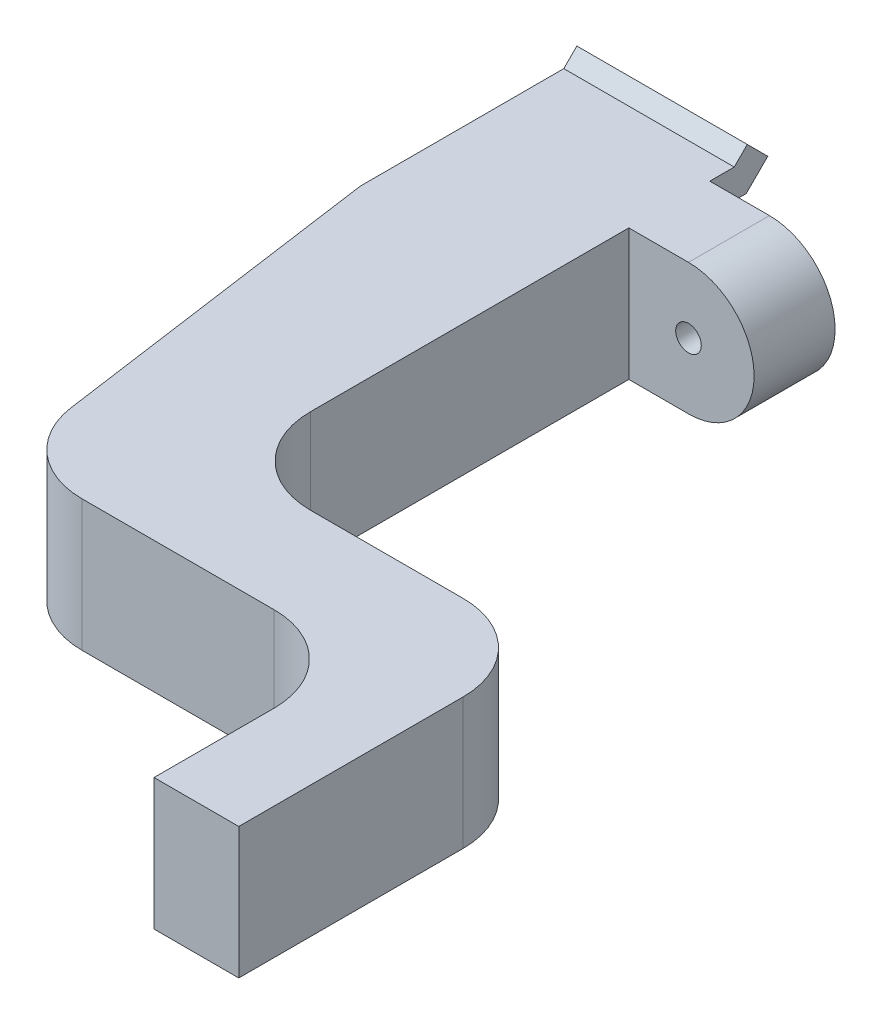
ISO-10303-21;
HEADER;
FILE_DESCRIPTION(('STEP AP214'),'2;1');
FILE_NAME('part.step','',(''),(''),'','','');
FILE_SCHEMA(('AUTOMOTIVE_DESIGN { 1 0 10303 214 1 1 1 1 }'));
ENDSEC;
DATA;
#1=APPLICATION_CONTEXT('core data for automotive mechanical design processes');
#2=APPLICATION_PROTOCOL_DEFINITION('international standard','automotive_design',2000,#1);
#3=PRODUCT_CONTEXT('',#1,'mechanical');
#4=PRODUCT('Part','Part','',(#3));
#5=PRODUCT_RELATED_PRODUCT_CATEGORY('part','',(#4));
#6=PRODUCT_DEFINITION_FORMATION('','',#4);
#7=PRODUCT_DEFINITION_CONTEXT('part definition',#1,'design');
#8=PRODUCT_DEFINITION('design','',#6,#7);
#9=PRODUCT_DEFINITION_SHAPE('','',#8);
#10=(LENGTH_UNIT() NAMED_UNIT(*) SI_UNIT(.MILLI.,.METRE.));
#11=(NAMED_UNIT(*) PLANE_ANGLE_UNIT() SI_UNIT($,.RADIAN.));
#12=(NAMED_UNIT(*) SI_UNIT($,.STERADIAN.) SOLID_ANGLE_UNIT());
#13=UNCERTAINTY_MEASURE_WITH_UNIT(LENGTH_MEASURE(1.E-05),#10,'distance_accuracy_value','');
#14=(GEOMETRIC_REPRESENTATION_CONTEXT(3) GLOBAL_UNCERTAINTY_ASSIGNED_CONTEXT((#13)) GLOBAL_UNIT_ASSIGNED_CONTEXT((#10,
#11,#12)) REPRESENTATION_CONTEXT('',''));
#15=CARTESIAN_POINT('',(0.,0.,0.));
#16=DIRECTION('',(0.,0.,1.));
#17=DIRECTION('',(1.,0.,0.));
#18=AXIS2_PLACEMENT_3D('',#15,#16,#17);
#19=CARTESIAN_POINT('',(5.,-5.8181568544759,5.));
#20=DIRECTION('',(-1.,0.,0.));
#21=DIRECTION('',(0.,0.,1.));
#22=AXIS2_PLACEMENT_3D('',#19,#20,#21);
#23=PLANE('',#22);
#24=DIRECTION('',(0.,0.,1.));
#25=VECTOR('',#24,1.);
#26=CARTESIAN_POINT('',(5.,5.77025558493693,-0.150000000000003));
#27=LINE('',#26,#25);
#28=CARTESIAN_POINT('',(5.,5.77025558493693,-1.43370490960978));
#29=VERTEX_POINT('',#28);
#30=CARTESIAN_POINT('',(5.,5.77025558493693,0.));
#31=VERTEX_POINT('',#30);
#32=EDGE_CURVE('E50',#29,#31,#27,.T.);
#33=ORIENTED_EDGE('',*,*,#32,.T.);
#34=DIRECTION('',(0.,-1.,0.));
#35=VECTOR('',#34,1.);
#36=CARTESIAN_POINT('',(5.,-1.92974441504707,0.));
#37=LINE('',#36,#35);
#38=CARTESIAN_POINT('',(5.,4.07025558493702,0.));
#39=VERTEX_POINT('',#38);
#40=EDGE_CURVE('E230',#31,#39,#37,.T.);
#41=ORIENTED_EDGE('',*,*,#40,.T.);
#42=DIRECTION('',(0.,-5.89805981832101E-13,-1.));
#43=VECTOR('',#42,1.);
#44=CARTESIAN_POINT('',(5.,4.07025558493702,0.));
#45=LINE('',#44,#43);
#46=CARTESIAN_POINT('',(5.,4.07025558493693,-2.13786796564404));
#47=VERTEX_POINT('',#46);
#48=EDGE_CURVE('E373',#39,#47,#45,.T.);
#49=ORIENTED_EDGE('',*,*,#48,.T.);
#50=DIRECTION('',(0.,0.707106781186548,-0.707106781186547));
#51=VECTOR('',#50,1.);
#52=CARTESIAN_POINT('',(5.,5.33446914731003,-3.40208152801713));
#53=LINE('',#52,#51);
#54=CARTESIAN_POINT('',(5.,5.33446914731003,-3.40208152801713));
#55=VERTEX_POINT('',#54);
#56=EDGE_CURVE('E371',#47,#55,#53,.T.);
#57=ORIENTED_EDGE('',*,*,#56,.T.);
#58=DIRECTION('',(0.,0.707106781186546,0.707106781186549));
#59=VECTOR('',#58,1.);
#60=CARTESIAN_POINT('',(5.,6.53655067532716,-2.2));
#61=LINE('',#60,#59);
#62=CARTESIAN_POINT('',(5.,6.53655067532716,-2.2));
#63=VERTEX_POINT('',#62);
#64=EDGE_CURVE('E368',#55,#63,#61,.T.);
#65=ORIENTED_EDGE('',*,*,#64,.T.);
#66=DIRECTION('',(0.,-0.707106781186548,0.707106781186547));
#67=VECTOR('',#66,1.);
#68=CARTESIAN_POINT('',(5.,5.77025558493693,-1.43370490960978));
#69=LINE('',#68,#67);
#70=EDGE_CURVE('E366',#63,#29,#69,.T.);
#71=ORIENTED_EDGE('',*,*,#70,.T.);
#72=EDGE_LOOP('',(#33,#41,#49,#57,#65,#71));
#73=FACE_BOUND('',#72,.T.);
#74=ADVANCED_FACE('F42',(#73),#23,.F.);
#75=DIRECTION('',(0.,0.,1.));
#76=VECTOR('',#75,1.);
#77=CARTESIAN_POINT('',(5.,-0.22974441506307,-0.150000000000003));
#78=LINE('',#77,#76);
#79=CARTESIAN_POINT('',(5.,-0.22974441506307,-1.43370490960978));
#80=VERTEX_POINT('',#79);
#81=CARTESIAN_POINT('',(5.,-0.22974441506307,0.));
#82=VERTEX_POINT('',#81);
#83=EDGE_CURVE('E227',#80,#82,#78,.T.);
#84=ORIENTED_EDGE('',*,*,#83,.T.);
#85=CARTESIAN_POINT('',(5.,-1.92974441504707,0.));
#86=VERTEX_POINT('',#85);
#87=EDGE_CURVE('E224',#82,#86,#37,.T.);
#88=ORIENTED_EDGE('',*,*,#87,.T.);
#89=DIRECTION('',(0.,-4.61147324030491E-13,-1.));
#90=VECTOR('',#89,1.);
#91=CARTESIAN_POINT('',(5.,-1.92974441506307,-0.150000000000003));
#92=LINE('',#91,#90);
#93=CARTESIAN_POINT('',(5.,-1.92974441506307,-2.13786796564404));
#94=VERTEX_POINT('',#93);
#95=EDGE_CURVE('E208',#86,#94,#92,.T.);
#96=ORIENTED_EDGE('',*,*,#95,.T.);
#97=DIRECTION('',(0.,0.707106781186549,-0.707106781186546));
#98=VECTOR('',#97,1.);
#99=CARTESIAN_POINT('',(5.,-0.665530852689974,-3.40208152801713));
#100=LINE('',#99,#98);
#101=CARTESIAN_POINT('',(5.,-0.665530852689974,-3.40208152801713));
#102=VERTEX_POINT('',#101);
#103=EDGE_CURVE('E220',#94,#102,#100,.T.);
#104=ORIENTED_EDGE('',*,*,#103,.T.);
#105=DIRECTION('',(0.,0.707106781186548,0.707106781186548));
#106=VECTOR('',#105,1.);
#107=CARTESIAN_POINT('',(5.,0.536550675327156,-2.2));
#108=LINE('',#107,#106);
#109=CARTESIAN_POINT('',(5.,0.536550675327156,-2.2));
#110=VERTEX_POINT('',#109);
#111=EDGE_CURVE('E339',#102,#110,#108,.T.);
#112=ORIENTED_EDGE('',*,*,#111,.T.);
#113=DIRECTION('',(0.,-0.707106781186546,0.707106781186549));
#114=VECTOR('',#113,1.);
#115=CARTESIAN_POINT('',(5.,-0.22974441506307,-1.43370490960978));
#116=LINE('',#115,#114);
#117=EDGE_CURVE('E337',#110,#80,#116,.T.);
#118=ORIENTED_EDGE('',*,*,#117,.T.);
#119=EDGE_LOOP('',(#84,#88,#96,#104,#112,#118));
#120=FACE_BOUND('',#119,.T.);
#121=ADVANCED_FACE('F225',(#120),#23,.F.);
#122=CARTESIAN_POINT('',(5.,-1.9297444150522,23.4327975796501));
#123=VERTEX_POINT('',#122);
#124=CARTESIAN_POINT('',(5.,-1.92974441506081,4.75000000000266));
#125=VERTEX_POINT('',#124);
#126=EDGE_CURVE('E219',#123,#125,#92,.T.);
#127=ORIENTED_EDGE('',*,*,#126,.T.);
#128=DIRECTION('',(0.,-1.,0.));
#129=VECTOR('',#128,1.);
#130=CARTESIAN_POINT('',(5.,-1.92974441504707,4.75000000000266));
#131=LINE('',#130,#129);
#132=CARTESIAN_POINT('',(5.,5.77025558493693,4.75000000000266));
#133=VERTEX_POINT('',#132);
#134=EDGE_CURVE('E57',#133,#125,#131,.T.);
#135=ORIENTED_EDGE('',*,*,#134,.F.);
#136=CARTESIAN_POINT('',(5.,5.77025558493693,23.4327975796501));
#137=VERTEX_POINT('',#136);
#138=EDGE_CURVE('E375',#133,#137,#27,.T.);
#139=ORIENTED_EDGE('',*,*,#138,.T.);
#140=DIRECTION('',(0.,1.,0.));
#141=VECTOR('',#140,1.);
#142=CARTESIAN_POINT('',(5.,-52.6225137457556,23.4327975796501));
#143=LINE('',#142,#141);
#144=EDGE_CURVE('E306',#123,#137,#143,.T.);
#145=ORIENTED_EDGE('',*,*,#144,.F.);
#146=EDGE_LOOP('',(#127,#135,#139,#145));
#147=FACE_BOUND('',#146,.T.);
#148=ADVANCED_FACE('F44',(#147),#23,.F.);
#149=CARTESIAN_POINT('',(-5.,-5.8181568544759,5.));
#150=DIRECTION('',(1.,0.,0.));
#151=DIRECTION('',(0.,0.,-1.));
#152=AXIS2_PLACEMENT_3D('',#149,#150,#151);
#153=PLANE('',#152);
#154=DIRECTION('',(0.,4.61147324030491E-13,1.));
#155=VECTOR('',#154,1.);
#156=CARTESIAN_POINT('',(-5.,-1.92974441506307,-0.150000000000003));
#157=LINE('',#156,#155);
#158=CARTESIAN_POINT('',(-5.,-1.92974441506307,-2.13786796564404));
#159=VERTEX_POINT('',#158);
#160=CARTESIAN_POINT('',(-5.,-1.92974441505816,10.5));
#161=VERTEX_POINT('',#160);
#162=EDGE_CURVE('E353',#159,#161,#157,.T.);
#163=ORIENTED_EDGE('',*,*,#162,.T.);
#164=DIRECTION('',(0.,1.,0.));
#165=VECTOR('',#164,1.);
#166=CARTESIAN_POINT('',(-5.,-52.6225137457556,10.5));
#167=LINE('',#166,#165);
#168=CARTESIAN_POINT('',(-5.,5.77025558493693,10.5));
#169=VERTEX_POINT('',#168);
#170=EDGE_CURVE('E302',#161,#169,#167,.T.);
#171=ORIENTED_EDGE('',*,*,#170,.T.);
#172=DIRECTION('',(0.,0.,-1.));
#173=VECTOR('',#172,1.);
#174=CARTESIAN_POINT('',(-5.,5.77025558493693,-0.150000000000003));
#175=LINE('',#174,#173);
#176=CARTESIAN_POINT('',(-5.,5.77025558493693,-1.43370490960978));
#177=VERTEX_POINT('',#176);
#178=EDGE_CURVE('E365',#169,#177,#175,.T.);
#179=ORIENTED_EDGE('',*,*,#178,.T.);
#180=DIRECTION('',(0.,0.707106781186548,-0.707106781186547));
#181=VECTOR('',#180,1.);
#182=CARTESIAN_POINT('',(-5.,5.77025558493693,-1.43370490960978));
#183=LINE('',#182,#181);
#184=CARTESIAN_POINT('',(-5.,6.53655067532716,-2.2));
#185=VERTEX_POINT('',#184);
#186=EDGE_CURVE('E378',#177,#185,#183,.T.);
#187=ORIENTED_EDGE('',*,*,#186,.T.);
#188=DIRECTION('',(0.,-0.707106781186546,-0.707106781186549));
#189=VECTOR('',#188,1.);
#190=CARTESIAN_POINT('',(-5.,6.53655067532716,-2.2));
#191=LINE('',#190,#189);
#192=CARTESIAN_POINT('',(-5.,5.33446914731003,-3.40208152801713));
#193=VERTEX_POINT('',#192);
#194=EDGE_CURVE('E381',#185,#193,#191,.T.);
#195=ORIENTED_EDGE('',*,*,#194,.T.);
#196=DIRECTION('',(0.,-0.707106781186548,0.707106781186547));
#197=VECTOR('',#196,1.);
#198=CARTESIAN_POINT('',(-5.,5.33446914731003,-3.40208152801713));
#199=LINE('',#198,#197);
#200=CARTESIAN_POINT('',(-5.,4.07025558493693,-2.13786796564404));
#201=VERTEX_POINT('',#200);
#202=EDGE_CURVE('E384',#193,#201,#199,.T.);
#203=ORIENTED_EDGE('',*,*,#202,.T.);
#204=DIRECTION('',(0.,5.89805981832101E-13,1.));
#205=VECTOR('',#204,1.);
#206=CARTESIAN_POINT('',(-5.,4.07025558493702,0.));
#207=LINE('',#206,#205);
#208=CARTESIAN_POINT('',(-5.,4.07025558493702,0.));
#209=VERTEX_POINT('',#208);
#210=EDGE_CURVE('E387',#201,#209,#207,.T.);
#211=ORIENTED_EDGE('',*,*,#210,.T.);
#212=DIRECTION('',(0.,-1.,0.));
#213=VECTOR('',#212,1.);
#214=CARTESIAN_POINT('',(-5.,-5.8181568544759,0.));
#215=LINE('',#214,#213);
#216=CARTESIAN_POINT('',(-5.,-0.229744415063002,0.));
#217=VERTEX_POINT('',#216);
#218=EDGE_CURVE('E12',#209,#217,#215,.T.);
#219=ORIENTED_EDGE('',*,*,#218,.T.);
#220=DIRECTION('',(0.,0.,-1.));
#221=VECTOR('',#220,1.);
#222=CARTESIAN_POINT('',(-5.,-0.22974441506307,-0.150000000000003));
#223=LINE('',#222,#221);
#224=CARTESIAN_POINT('',(-5.,-0.22974441506307,-1.43370490960978));
#225=VERTEX_POINT('',#224);
#226=EDGE_CURVE('E336',#217,#225,#223,.T.);
#227=ORIENTED_EDGE('',*,*,#226,.T.);
#228=DIRECTION('',(0.,0.707106781186546,-0.707106781186549));
#229=VECTOR('',#228,1.);
#230=CARTESIAN_POINT('',(-5.,-0.22974441506307,-1.43370490960978));
#231=LINE('',#230,#229);
#232=CARTESIAN_POINT('',(-5.,0.536550675327156,-2.2));
#233=VERTEX_POINT('',#232);
#234=EDGE_CURVE('E344',#225,#233,#231,.T.);
#235=ORIENTED_EDGE('',*,*,#234,.T.);
#236=DIRECTION('',(0.,-0.707106781186548,-0.707106781186548));
#237=VECTOR('',#236,1.);
#238=CARTESIAN_POINT('',(-5.,0.536550675327156,-2.2));
#239=LINE('',#238,#237);
#240=CARTESIAN_POINT('',(-5.,-0.665530852689974,-3.40208152801713));
#241=VERTEX_POINT('',#240);
#242=EDGE_CURVE('E347',#233,#241,#239,.T.);
#243=ORIENTED_EDGE('',*,*,#242,.T.);
#244=DIRECTION('',(0.,-0.707106781186549,0.707106781186546));
#245=VECTOR('',#244,1.);
#246=CARTESIAN_POINT('',(-5.,-0.665530852689974,-3.40208152801713));
#247=LINE('',#246,#245);
#248=EDGE_CURVE('E350',#241,#159,#247,.T.);
#249=ORIENTED_EDGE('',*,*,#248,.T.);
#250=EDGE_LOOP('',(#163,#171,#179,#187,#195,#203,#211,#219,#227,#235,#243,#249));
#251=FACE_BOUND('',#250,.T.);
#252=ADVANCED_FACE('F442',(#251),#153,.F.);
#253=CARTESIAN_POINT('',(0.,0.,0.));
#254=DIRECTION('',(0.,0.,-1.));
#255=DIRECTION('',(-1.,0.,0.));
#256=AXIS2_PLACEMENT_3D('',#253,#254,#255);
#257=PLANE('',#256);
#258=DIRECTION('',(-1.,0.,0.));
#259=VECTOR('',#258,1.);
#260=CARTESIAN_POINT('',(9.20199597764661,-0.229744415063002,0.));
#261=LINE('',#260,#259);
#262=EDGE_CURVE('E355',#82,#217,#261,.T.);
#263=ORIENTED_EDGE('',*,*,#262,.T.);
#264=ORIENTED_EDGE('',*,*,#218,.F.);
#265=DIRECTION('',(-1.,0.,0.));
#266=VECTOR('',#265,1.);
#267=CARTESIAN_POINT('',(9.20199597764661,4.07025558493702,0.));
#268=LINE('',#267,#266);
#269=EDGE_CURVE('E369',#39,#209,#268,.T.);
#270=ORIENTED_EDGE('',*,*,#269,.F.);
#271=ORIENTED_EDGE('',*,*,#40,.F.);
#272=DIRECTION('',(-1.,0.,0.));
#273=VECTOR('',#272,1.);
#274=CARTESIAN_POINT('',(5.,5.77025558493694,0.));
#275=LINE('',#274,#273);
#276=CARTESIAN_POINT('',(8.5,5.77025558493694,0.));
#277=VERTEX_POINT('',#276);
#278=EDGE_CURVE('E239',#277,#31,#275,.T.);
#279=ORIENTED_EDGE('',*,*,#278,.F.);
#280=CARTESIAN_POINT('',(8.5,1.92025558494493,0.));
#281=DIRECTION('',(0.,0.,1.));
#282=DIRECTION('',(-1.,0.,0.));
#283=AXIS2_PLACEMENT_3D('',#280,#281,#282);
#284=CIRCLE('',#283,3.84999999999201);
#285=CARTESIAN_POINT('',(8.5,-1.92974441504708,0.));
#286=VERTEX_POINT('',#285);
#287=EDGE_CURVE('E237',#286,#277,#284,.T.);
#288=ORIENTED_EDGE('',*,*,#287,.F.);
#289=DIRECTION('',(1.,0.,0.));
#290=VECTOR('',#289,1.);
#291=CARTESIAN_POINT('',(8.5,-1.92974441504707,0.));
#292=LINE('',#291,#290);
#293=EDGE_CURVE('E213',#86,#286,#292,.T.);
#294=ORIENTED_EDGE('',*,*,#293,.F.);
#295=ORIENTED_EDGE('',*,*,#87,.F.);
#296=EDGE_LOOP('',(#263,#264,#270,#271,#279,#288,#294,#295));
#297=FACE_BOUND('',#296,.T.);
#298=CARTESIAN_POINT('',(8.5,1.92025558494493,0.));
#299=DIRECTION('',(0.,0.,1.));
#300=DIRECTION('',(1.,0.,0.));
#301=AXIS2_PLACEMENT_3D('',#298,#299,#300);
#302=CIRCLE('',#301,0.750000000000108);
#303=CARTESIAN_POINT('',(9.25000000000011,1.92025558494493,0.));
#304=VERTEX_POINT('',#303);
#305=EDGE_CURVE('E231',#304,#304,#302,.T.);
#306=ORIENTED_EDGE('',*,*,#305,.T.);
#307=EDGE_LOOP('',(#306));
#308=FACE_BOUND('',#307,.T.);
#309=ADVANCED_FACE('F233',(#297,#308),#257,.T.);
#310=CARTESIAN_POINT('',(9.20199597764661,4.07025558493702,0.));
#311=DIRECTION('',(0.,-1.,5.89805981832101E-13));
#312=DIRECTION('',(0.,-5.89805981832101E-13,-1.));
#313=AXIS2_PLACEMENT_3D('',#310,#311,#312);
#314=PLANE('',#313);
#315=ORIENTED_EDGE('',*,*,#48,.F.);
#316=ORIENTED_EDGE('',*,*,#269,.T.);
#317=ORIENTED_EDGE('',*,*,#210,.F.);
#318=DIRECTION('',(-1.,0.,0.));
#319=VECTOR('',#318,1.);
#320=CARTESIAN_POINT('',(9.20199597764661,4.07025558493693,-2.13786796564404));
#321=LINE('',#320,#319);
#322=EDGE_CURVE('E393',#47,#201,#321,.T.);
#323=ORIENTED_EDGE('',*,*,#322,.F.);
#324=EDGE_LOOP('',(#315,#316,#317,#323));
#325=FACE_BOUND('',#324,.T.);
#326=ADVANCED_FACE('F440',(#325),#314,.T.);
#327=CARTESIAN_POINT('',(9.20199597764661,5.33446914731003,-3.40208152801713));
#328=DIRECTION('',(0.,-0.707106781186547,-0.707106781186548));
#329=DIRECTION('',(0.,0.707106781186548,-0.707106781186547));
#330=AXIS2_PLACEMENT_3D('',#327,#328,#329);
#331=PLANE('',#330);
#332=ORIENTED_EDGE('',*,*,#56,.F.);
#333=ORIENTED_EDGE('',*,*,#322,.T.);
#334=ORIENTED_EDGE('',*,*,#202,.F.);
#335=DIRECTION('',(-1.,0.,0.));
#336=VECTOR('',#335,1.);
#337=CARTESIAN_POINT('',(9.20199597764661,5.33446914731003,-3.40208152801713));
#338=LINE('',#337,#336);
#339=EDGE_CURVE('E395',#55,#193,#338,.T.);
#340=ORIENTED_EDGE('',*,*,#339,.F.);
#341=EDGE_LOOP('',(#332,#333,#334,#340));
#342=FACE_BOUND('',#341,.T.);
#343=ADVANCED_FACE('F437',(#342),#331,.T.);
#344=CARTESIAN_POINT('',(9.20199597764661,6.53655067532716,-2.2));
#345=DIRECTION('',(0.,0.707106781186549,-0.707106781186546));
#346=DIRECTION('',(0.,0.707106781186546,0.707106781186549));
#347=AXIS2_PLACEMENT_3D('',#344,#345,#346);
#348=PLANE('',#347);
#349=ORIENTED_EDGE('',*,*,#64,.F.);
#350=ORIENTED_EDGE('',*,*,#339,.T.);
#351=ORIENTED_EDGE('',*,*,#194,.F.);
#352=DIRECTION('',(-1.,0.,0.));
#353=VECTOR('',#352,1.);
#354=CARTESIAN_POINT('',(9.20199597764661,6.53655067532716,-2.2));
#355=LINE('',#354,#353);
#356=EDGE_CURVE('E397',#63,#185,#355,.T.);
#357=ORIENTED_EDGE('',*,*,#356,.F.);
#358=EDGE_LOOP('',(#349,#350,#351,#357));
#359=FACE_BOUND('',#358,.T.);
#360=ADVANCED_FACE('F447',(#359),#348,.T.);
#361=CARTESIAN_POINT('',(9.20199597764661,5.77025558493693,-1.43370490960978));
#362=DIRECTION('',(0.,0.707106781186547,0.707106781186548));
#363=DIRECTION('',(0.,-0.707106781186548,0.707106781186547));
#364=AXIS2_PLACEMENT_3D('',#361,#362,#363);
#365=PLANE('',#364);
#366=ORIENTED_EDGE('',*,*,#70,.F.);
#367=ORIENTED_EDGE('',*,*,#356,.T.);
#368=ORIENTED_EDGE('',*,*,#186,.F.);
#369=DIRECTION('',(-1.,0.,0.));
#370=VECTOR('',#369,1.);
#371=CARTESIAN_POINT('',(9.20199597764661,5.77025558493693,-1.43370490960978));
#372=LINE('',#371,#370);
#373=EDGE_CURVE('E390',#29,#177,#372,.T.);
#374=ORIENTED_EDGE('',*,*,#373,.F.);
#375=EDGE_LOOP('',(#366,#367,#368,#374));
#376=FACE_BOUND('',#375,.T.);
#377=ADVANCED_FACE('F451',(#376),#365,.T.);
#378=CARTESIAN_POINT('',(9.20199597764661,5.77025558493693,-0.150000000000003));
#379=DIRECTION('',(0.,1.,0.));
#380=DIRECTION('',(0.,0.,1.));
#381=AXIS2_PLACEMENT_3D('',#378,#379,#380);
#382=PLANE('',#381);
#383=ORIENTED_EDGE('',*,*,#32,.F.);
#384=ORIENTED_EDGE('',*,*,#373,.T.);
#385=ORIENTED_EDGE('',*,*,#178,.F.);
#386=DIRECTION('',(0.139173100960066,0.,0.99026806874157));
#387=VECTOR('',#386,1.);
#388=CARTESIAN_POINT('',(-5.,5.77025558493693,10.5));
#389=LINE('',#388,#387);
#390=CARTESIAN_POINT('',(-2.2245453143182,5.77025558493693,30.2483862363496));
#391=VERTEX_POINT('',#390);
#392=EDGE_CURVE('E260',#169,#391,#389,.T.);
#393=ORIENTED_EDGE('',*,*,#392,.T.);
#394=CARTESIAN_POINT('',(2.72679502938965,5.77025558493693,29.5525207315493));
#395=DIRECTION('',(0.,1.,0.));
#396=DIRECTION('',(0.,0.,-1.));
#397=AXIS2_PLACEMENT_3D('',#394,#395,#396);
#398=CIRCLE('',#397,5.);
#399=CARTESIAN_POINT('',(2.72679502938969,5.77025558493693,34.5525207315493));
#400=VERTEX_POINT('',#399);
#401=EDGE_CURVE('E257',#391,#400,#398,.T.);
#402=ORIENTED_EDGE('',*,*,#401,.T.);
#403=DIRECTION('',(1.,0.,0.));
#404=VECTOR('',#403,1.);
#405=CARTESIAN_POINT('',(13.9955775475064,5.77025558493693,34.5525207315493));
#406=LINE('',#405,#404);
#407=CARTESIAN_POINT('',(13.9955775475064,5.77025558493693,34.5525207315493));
#408=VERTEX_POINT('',#407);
#409=EDGE_CURVE('E253',#400,#408,#406,.T.);
#410=ORIENTED_EDGE('',*,*,#409,.T.);
#411=CARTESIAN_POINT('',(13.9955775475064,5.77025558493693,39.5525207315493));
#412=DIRECTION('',(0.,-1.,0.));
#413=DIRECTION('',(0.,0.,1.));
#414=AXIS2_PLACEMENT_3D('',#411,#412,#413);
#415=CIRCLE('',#414,5.);
#416=CARTESIAN_POINT('',(18.9955775475064,5.77025558493693,39.5525207315493));
#417=VERTEX_POINT('',#416);
#418=EDGE_CURVE('E248',#408,#417,#415,.T.);
#419=ORIENTED_EDGE('',*,*,#418,.T.);
#420=DIRECTION('',(0.,0.,1.));
#421=VECTOR('',#420,1.);
#422=CARTESIAN_POINT('',(18.9955775475064,5.77025558493693,46.6007256868508));
#423=LINE('',#422,#421);
#424=CARTESIAN_POINT('',(18.9955775475064,5.77025558493693,46.6007256868508));
#425=VERTEX_POINT('',#424);
#426=EDGE_CURVE('E278',#417,#425,#423,.T.);
#427=ORIENTED_EDGE('',*,*,#426,.T.);
#428=DIRECTION('',(1.,0.,0.));
#429=VECTOR('',#428,1.);
#430=CARTESIAN_POINT('',(23.9678526084245,5.77025558493693,46.6007256868508));
#431=LINE('',#430,#429);
#432=CARTESIAN_POINT('',(23.9678526084245,5.77025558493693,46.6007256868508));
#433=VERTEX_POINT('',#432);
#434=EDGE_CURVE('E275',#425,#433,#431,.T.);
#435=ORIENTED_EDGE('',*,*,#434,.T.);
#436=DIRECTION('',(0.,0.,-1.));
#437=VECTOR('',#436,1.);
#438=CARTESIAN_POINT('',(23.9678526084245,5.77025558493693,33.4327975796501));
#439=LINE('',#438,#437);
#440=CARTESIAN_POINT('',(23.9678526084245,5.77025558493693,33.4327975796501));
#441=VERTEX_POINT('',#440);
#442=EDGE_CURVE('E272',#433,#441,#439,.T.);
#443=ORIENTED_EDGE('',*,*,#442,.T.);
#444=CARTESIAN_POINT('',(18.9678526084245,5.77025558493693,33.4327975796501));
#445=DIRECTION('',(0.,1.,0.));
#446=DIRECTION('',(0.,0.,-1.));
#447=AXIS2_PLACEMENT_3D('',#444,#445,#446);
#448=CIRCLE('',#447,5.);
#449=CARTESIAN_POINT('',(18.9678526084245,5.77025558493693,28.4327975796501));
#450=VERTEX_POINT('',#449);
#451=EDGE_CURVE('E269',#441,#450,#448,.T.);
#452=ORIENTED_EDGE('',*,*,#451,.T.);
#453=DIRECTION('',(-1.,0.,0.));
#454=VECTOR('',#453,1.);
#455=CARTESIAN_POINT('',(10.,5.77025558493693,28.4327975796501));
#456=LINE('',#455,#454);
#457=CARTESIAN_POINT('',(10.,5.77025558493693,28.4327975796501));
#458=VERTEX_POINT('',#457);
#459=EDGE_CURVE('E266',#450,#458,#456,.T.);
#460=ORIENTED_EDGE('',*,*,#459,.T.);
#461=CARTESIAN_POINT('',(10.,5.77025558493693,23.4327975796501));
#462=DIRECTION('',(0.,-1.,0.));
#463=DIRECTION('',(0.,0.,1.));
#464=AXIS2_PLACEMENT_3D('',#461,#462,#463);
#465=CIRCLE('',#464,5.);
#466=EDGE_CURVE('E263',#458,#137,#465,.T.);
#467=ORIENTED_EDGE('',*,*,#466,.T.);
#468=ORIENTED_EDGE('',*,*,#138,.F.);
#469=DIRECTION('',(-1.,0.,0.));
#470=VECTOR('',#469,1.);
#471=CARTESIAN_POINT('',(5.,5.77025558493694,4.75000000000266));
#472=LINE('',#471,#470);
#473=CARTESIAN_POINT('',(8.5,5.77025558493694,4.75000000000266));
#474=VERTEX_POINT('',#473);
#475=EDGE_CURVE('E252',#474,#133,#472,.T.);
#476=ORIENTED_EDGE('',*,*,#475,.F.);
#477=DIRECTION('',(0.,0.,-1.));
#478=VECTOR('',#477,1.);
#479=CARTESIAN_POINT('',(8.5,5.77025558493694,17.3948344280075));
#480=LINE('',#479,#478);
#481=EDGE_CURVE('E244',#474,#277,#480,.T.);
#482=ORIENTED_EDGE('',*,*,#481,.T.);
#483=ORIENTED_EDGE('',*,*,#278,.T.);
#484=EDGE_LOOP('',(#383,#384,#385,#393,#402,#410,#419,#427,#435,#443,#452,#460,#467,#468,#476,
#482,#483));
#485=FACE_BOUND('',#484,.T.);
#486=ADVANCED_FACE('F407',(#485),#382,.T.);
#487=CARTESIAN_POINT('',(9.20199597764661,-1.92974441506307,-0.150000000000003));
#488=DIRECTION('',(0.,-1.,4.61147324030491E-13));
#489=DIRECTION('',(0.,-4.61147324030491E-13,-1.));
#490=AXIS2_PLACEMENT_3D('',#487,#488,#489);
#491=PLANE('',#490);
#492=ORIENTED_EDGE('',*,*,#126,.F.);
#493=CARTESIAN_POINT('',(10.,-1.9297444150522,23.4327975796501));
#494=DIRECTION('',(0.,-1.,4.61147324030491E-13));
#495=DIRECTION('',(0.,-4.61147324030491E-13,-1.));
#496=AXIS2_PLACEMENT_3D('',#493,#494,#495);
#497=CIRCLE('',#496,5.);
#498=CARTESIAN_POINT('',(10.,-1.92974441504989,28.4327975796501));
#499=VERTEX_POINT('',#498);
#500=EDGE_CURVE('E303',#499,#123,#497,.T.);
#501=ORIENTED_EDGE('',*,*,#500,.F.);
#502=DIRECTION('',(-1.,0.,0.));
#503=VECTOR('',#502,1.);
#504=CARTESIAN_POINT('',(10.,-1.92974441504989,28.4327975796501));
#505=LINE('',#504,#503);
#506=CARTESIAN_POINT('',(18.9678526084245,-1.92974441504989,28.4327975796501));
#507=VERTEX_POINT('',#506);
#508=EDGE_CURVE('E308',#507,#499,#505,.T.);
#509=ORIENTED_EDGE('',*,*,#508,.F.);
#510=CARTESIAN_POINT('',(18.9678526084245,-1.92974441504758,33.4327975796501));
#511=DIRECTION('',(0.,-1.,4.61147324030491E-13));
#512=DIRECTION('',(0.,-4.61147324030491E-13,-1.));
#513=AXIS2_PLACEMENT_3D('',#510,#511,#512);
#514=CIRCLE('',#513,5.);
#515=CARTESIAN_POINT('',(23.9678526084245,-1.92974441504758,33.4327975796501));
#516=VERTEX_POINT('',#515);
#517=EDGE_CURVE('E312',#516,#507,#514,.F.);
#518=ORIENTED_EDGE('',*,*,#517,.F.);
#519=DIRECTION('',(0.,-4.61147324030491E-13,-1.));
#520=VECTOR('',#519,1.);
#521=CARTESIAN_POINT('',(23.9678526084245,-1.92974441504758,33.4327975796268));
#522=LINE('',#521,#520);
#523=CARTESIAN_POINT('',(23.9678526084245,-1.92974441504151,46.6007256868508));
#524=VERTEX_POINT('',#523);
#525=EDGE_CURVE('E316',#524,#516,#522,.T.);
#526=ORIENTED_EDGE('',*,*,#525,.F.);
#527=DIRECTION('',(1.,0.,0.));
#528=VECTOR('',#527,1.);
#529=CARTESIAN_POINT('',(23.9678526084245,-1.92974441504151,46.6007256868508));
#530=LINE('',#529,#528);
#531=CARTESIAN_POINT('',(18.9955775475064,-1.92974441504314,46.6007256868508));
#532=VERTEX_POINT('',#531);
#533=EDGE_CURVE('E320',#532,#524,#530,.T.);
#534=ORIENTED_EDGE('',*,*,#533,.F.);
#535=DIRECTION('',(0.,4.61147324030491E-13,1.));
#536=VECTOR('',#535,1.);
#537=CARTESIAN_POINT('',(18.9955775475064,-1.92974441504151,46.6007256868274));
#538=LINE('',#537,#536);
#539=CARTESIAN_POINT('',(18.9955775475064,-1.92974441504476,39.5525207315493));
#540=VERTEX_POINT('',#539);
#541=EDGE_CURVE('E256',#540,#532,#538,.T.);
#542=ORIENTED_EDGE('',*,*,#541,.F.);
#543=CARTESIAN_POINT('',(13.9955775475064,-1.92974441504476,39.5525207315493));
#544=DIRECTION('',(0.,-1.,4.61147324030491E-13));
#545=DIRECTION('',(0.,-4.61147324030491E-13,-1.));
#546=AXIS2_PLACEMENT_3D('',#543,#544,#545);
#547=CIRCLE('',#546,5.);
#548=CARTESIAN_POINT('',(13.9955775475064,-1.92974441504707,34.5525207315493));
#549=VERTEX_POINT('',#548);
#550=EDGE_CURVE('E286',#549,#540,#547,.T.);
#551=ORIENTED_EDGE('',*,*,#550,.F.);
#552=DIRECTION('',(1.,0.,0.));
#553=VECTOR('',#552,1.);
#554=CARTESIAN_POINT('',(13.9955775475064,-1.92974441504707,34.5525207315493));
#555=LINE('',#554,#553);
#556=CARTESIAN_POINT('',(2.72679502938969,-1.92974441504707,34.5525207315493));
#557=VERTEX_POINT('',#556);
#558=EDGE_CURVE('E291',#557,#549,#555,.T.);
#559=ORIENTED_EDGE('',*,*,#558,.F.);
#560=CARTESIAN_POINT('',(2.72679502938965,-1.92974441504937,29.5525207315493));
#561=DIRECTION('',(0.,-1.,4.61147324030491E-13));
#562=DIRECTION('',(0.,-4.61147324030491E-13,-1.));
#563=AXIS2_PLACEMENT_3D('',#560,#561,#562);
#564=CIRCLE('',#563,5.);
#565=CARTESIAN_POINT('',(-2.2245453143182,-1.92974441504905,30.2483862363496));
#566=VERTEX_POINT('',#565);
#567=EDGE_CURVE('E295',#566,#557,#564,.F.);
#568=ORIENTED_EDGE('',*,*,#567,.F.);
#569=DIRECTION('',(0.139173100960066,4.56659469973017E-13,0.99026806874157));
#570=VECTOR('',#569,1.);
#571=CARTESIAN_POINT('',(-5.00000000000322,-1.92974441505816,10.4999999999771));
#572=LINE('',#571,#570);
#573=EDGE_CURVE('E299',#161,#566,#572,.T.);
#574=ORIENTED_EDGE('',*,*,#573,.F.);
#575=ORIENTED_EDGE('',*,*,#162,.F.);
#576=DIRECTION('',(-1.,0.,0.));
#577=VECTOR('',#576,1.);
#578=CARTESIAN_POINT('',(9.20199597764661,-1.92974441506307,-2.13786796564404));
#579=LINE('',#578,#577);
#580=EDGE_CURVE('E216',#94,#159,#579,.T.);
#581=ORIENTED_EDGE('',*,*,#580,.F.);
#582=ORIENTED_EDGE('',*,*,#95,.F.);
#583=ORIENTED_EDGE('',*,*,#293,.T.);
#584=DIRECTION('',(0.,0.,-1.));
#585=VECTOR('',#584,1.);
#586=CARTESIAN_POINT('',(8.5,-1.92974441504708,17.3948344280075));
#587=LINE('',#586,#585);
#588=CARTESIAN_POINT('',(8.5,-1.92974441504708,4.75000000000266));
#589=VERTEX_POINT('',#588);
#590=EDGE_CURVE('E246',#589,#286,#587,.T.);
#591=ORIENTED_EDGE('',*,*,#590,.F.);
#592=DIRECTION('',(1.,0.,0.));
#593=VECTOR('',#592,1.);
#594=CARTESIAN_POINT('',(8.5,-1.92974441504707,4.75000000000266));
#595=LINE('',#594,#593);
#596=EDGE_CURVE('E416',#125,#589,#595,.T.);
#597=ORIENTED_EDGE('',*,*,#596,.F.);
#598=EDGE_LOOP('',(#492,#501,#509,#518,#526,#534,#542,#551,#559,#568,#574,#575,#581,#582,#583,
#591,#597));
#599=FACE_BOUND('',#598,.T.);
#600=ADVANCED_FACE('F210',(#599),#491,.T.);
#601=CARTESIAN_POINT('',(9.20199597764661,-0.665530852689974,-3.40208152801713));
#602=DIRECTION('',(0.,-0.707106781186546,-0.707106781186549));
#603=DIRECTION('',(0.,0.707106781186549,-0.707106781186546));
#604=AXIS2_PLACEMENT_3D('',#601,#602,#603);
#605=PLANE('',#604);
#606=ORIENTED_EDGE('',*,*,#103,.F.);
#607=ORIENTED_EDGE('',*,*,#580,.T.);
#608=ORIENTED_EDGE('',*,*,#248,.F.);
#609=DIRECTION('',(-1.,0.,0.));
#610=VECTOR('',#609,1.);
#611=CARTESIAN_POINT('',(9.20199597764661,-0.665530852689974,-3.40208152801713));
#612=LINE('',#611,#610);
#613=EDGE_CURVE('E357',#102,#241,#612,.T.);
#614=ORIENTED_EDGE('',*,*,#613,.F.);
#615=EDGE_LOOP('',(#606,#607,#608,#614));
#616=FACE_BOUND('',#615,.T.);
#617=ADVANCED_FACE('F527',(#616),#605,.T.);
#618=CARTESIAN_POINT('',(9.20199597764661,0.536550675327156,-2.2));
#619=DIRECTION('',(0.,0.707106781186547,-0.707106781186547));
#620=DIRECTION('',(0.,0.707106781186548,0.707106781186548));
#621=AXIS2_PLACEMENT_3D('',#618,#619,#620);
#622=PLANE('',#621);
#623=ORIENTED_EDGE('',*,*,#111,.F.);
#624=ORIENTED_EDGE('',*,*,#613,.T.);
#625=ORIENTED_EDGE('',*,*,#242,.F.);
#626=DIRECTION('',(-1.,0.,0.));
#627=VECTOR('',#626,1.);
#628=CARTESIAN_POINT('',(9.20199597764661,0.536550675327156,-2.2));
#629=LINE('',#628,#627);
#630=EDGE_CURVE('E359',#110,#233,#629,.T.);
#631=ORIENTED_EDGE('',*,*,#630,.F.);
#632=EDGE_LOOP('',(#623,#624,#625,#631));
#633=FACE_BOUND('',#632,.T.);
#634=ADVANCED_FACE('F523',(#633),#622,.T.);
#635=CARTESIAN_POINT('',(9.20199597764661,-0.22974441506307,-1.43370490960978));
#636=DIRECTION('',(0.,0.707106781186549,0.707106781186546));
#637=DIRECTION('',(0.,-0.707106781186546,0.707106781186549));
#638=AXIS2_PLACEMENT_3D('',#635,#636,#637);
#639=PLANE('',#638);
#640=ORIENTED_EDGE('',*,*,#117,.F.);
#641=ORIENTED_EDGE('',*,*,#630,.T.);
#642=ORIENTED_EDGE('',*,*,#234,.F.);
#643=DIRECTION('',(-1.,0.,0.));
#644=VECTOR('',#643,1.);
#645=CARTESIAN_POINT('',(9.20199597764661,-0.22974441506307,-1.43370490960978));
#646=LINE('',#645,#644);
#647=EDGE_CURVE('E361',#80,#225,#646,.T.);
#648=ORIENTED_EDGE('',*,*,#647,.F.);
#649=EDGE_LOOP('',(#640,#641,#642,#648));
#650=FACE_BOUND('',#649,.T.);
#651=ADVANCED_FACE('F520',(#650),#639,.T.);
#652=CARTESIAN_POINT('',(9.20199597764661,-0.22974441506307,-0.150000000000003));
#653=DIRECTION('',(0.,1.,0.));
#654=DIRECTION('',(0.,0.,1.));
#655=AXIS2_PLACEMENT_3D('',#652,#653,#654);
#656=PLANE('',#655);
#657=ORIENTED_EDGE('',*,*,#83,.F.);
#658=ORIENTED_EDGE('',*,*,#647,.T.);
#659=ORIENTED_EDGE('',*,*,#226,.F.);
#660=ORIENTED_EDGE('',*,*,#262,.F.);
#661=EDGE_LOOP('',(#657,#658,#659,#660));
#662=FACE_BOUND('',#661,.T.);
#663=ADVANCED_FACE('F517',(#662),#656,.T.);
#664=CARTESIAN_POINT('',(18.9955775475064,-52.6225137457556,46.6007256868508));
#665=DIRECTION('',(-1.,0.,0.));
#666=DIRECTION('',(0.,0.,1.));
#667=AXIS2_PLACEMENT_3D('',#664,#665,#666);
#668=PLANE('',#667);
#669=DIRECTION('',(0.,1.,0.));
#670=VECTOR('',#669,1.);
#671=CARTESIAN_POINT('',(18.9955775475064,-52.6225137457556,39.5525207315493));
#672=LINE('',#671,#670);
#673=EDGE_CURVE('E289',#540,#417,#672,.T.);
#674=ORIENTED_EDGE('',*,*,#673,.F.);
#675=ORIENTED_EDGE('',*,*,#541,.T.);
#676=DIRECTION('',(0.,1.,0.));
#677=VECTOR('',#676,1.);
#678=CARTESIAN_POINT('',(18.9955775475064,-52.6225137457556,46.6007256868508));
#679=LINE('',#678,#677);
#680=EDGE_CURVE('E285',#532,#425,#679,.T.);
#681=ORIENTED_EDGE('',*,*,#680,.T.);
#682=ORIENTED_EDGE('',*,*,#426,.F.);
#683=EDGE_LOOP('',(#674,#675,#681,#682));
#684=FACE_BOUND('',#683,.T.);
#685=ADVANCED_FACE('F473',(#684),#668,.T.);
#686=CARTESIAN_POINT('',(23.9678526084245,-52.6225137457556,46.6007256868508));
#687=DIRECTION('',(0.,0.,1.));
#688=DIRECTION('',(1.,0.,0.));
#689=AXIS2_PLACEMENT_3D('',#686,#687,#688);
#690=PLANE('',#689);
#691=ORIENTED_EDGE('',*,*,#680,.F.);
#692=ORIENTED_EDGE('',*,*,#533,.T.);
#693=DIRECTION('',(0.,1.,0.));
#694=VECTOR('',#693,1.);
#695=CARTESIAN_POINT('',(23.9678526084245,-52.6225137457556,46.6007256868508));
#696=LINE('',#695,#694);
#697=EDGE_CURVE('E319',#524,#433,#696,.T.);
#698=ORIENTED_EDGE('',*,*,#697,.T.);
#699=ORIENTED_EDGE('',*,*,#434,.F.);
#700=EDGE_LOOP('',(#691,#692,#698,#699));
#701=FACE_BOUND('',#700,.T.);
#702=ADVANCED_FACE('F476',(#701),#690,.T.);
#703=CARTESIAN_POINT('',(23.9678526084245,-52.6225137457556,33.4327975796501));
#704=DIRECTION('',(1.,0.,0.));
#705=DIRECTION('',(0.,0.,-1.));
#706=AXIS2_PLACEMENT_3D('',#703,#704,#705);
#707=PLANE('',#706);
#708=ORIENTED_EDGE('',*,*,#697,.F.);
#709=ORIENTED_EDGE('',*,*,#525,.T.);
#710=DIRECTION('',(0.,1.,0.));
#711=VECTOR('',#710,1.);
#712=CARTESIAN_POINT('',(23.9678526084245,-52.6225137457556,33.4327975796501));
#713=LINE('',#712,#711);
#714=EDGE_CURVE('E315',#516,#441,#713,.T.);
#715=ORIENTED_EDGE('',*,*,#714,.T.);
#716=ORIENTED_EDGE('',*,*,#442,.F.);
#717=EDGE_LOOP('',(#708,#709,#715,#716));
#718=FACE_BOUND('',#717,.T.);
#719=ADVANCED_FACE('F480',(#718),#707,.T.);
#720=CARTESIAN_POINT('',(18.9678526084245,-52.6225137457556,33.4327975796501));
#721=DIRECTION('',(0.,1.,0.));
#722=DIRECTION('',(0.,0.,1.));
#723=AXIS2_PLACEMENT_3D('',#720,#721,#722);
#724=CYLINDRICAL_SURFACE('',#723,5.);
#725=ORIENTED_EDGE('',*,*,#714,.F.);
#726=ORIENTED_EDGE('',*,*,#517,.T.);
#727=DIRECTION('',(0.,1.,0.));
#728=VECTOR('',#727,1.);
#729=CARTESIAN_POINT('',(18.9678526084245,-52.6225137457556,28.4327975796501));
#730=LINE('',#729,#728);
#731=EDGE_CURVE('E311',#507,#450,#730,.T.);
#732=ORIENTED_EDGE('',*,*,#731,.T.);
#733=ORIENTED_EDGE('',*,*,#451,.F.);
#734=EDGE_LOOP('',(#725,#726,#732,#733));
#735=FACE_BOUND('',#734,.T.);
#736=ADVANCED_FACE('F482',(#735),#724,.T.);
#737=CARTESIAN_POINT('',(10.,-52.6225137457556,28.4327975796501));
#738=DIRECTION('',(0.,0.,-1.));
#739=DIRECTION('',(-1.,0.,0.));
#740=AXIS2_PLACEMENT_3D('',#737,#738,#739);
#741=PLANE('',#740);
#742=ORIENTED_EDGE('',*,*,#731,.F.);
#743=ORIENTED_EDGE('',*,*,#508,.T.);
#744=DIRECTION('',(0.,1.,0.));
#745=VECTOR('',#744,1.);
#746=CARTESIAN_POINT('',(10.,-52.6225137457556,28.4327975796501));
#747=LINE('',#746,#745);
#748=EDGE_CURVE('E307',#499,#458,#747,.T.);
#749=ORIENTED_EDGE('',*,*,#748,.T.);
#750=ORIENTED_EDGE('',*,*,#459,.F.);
#751=EDGE_LOOP('',(#742,#743,#749,#750));
#752=FACE_BOUND('',#751,.T.);
#753=ADVANCED_FACE('F412',(#752),#741,.T.);
#754=CARTESIAN_POINT('',(10.,-52.6225137457556,23.4327975796501));
#755=DIRECTION('',(0.,1.,0.));
#756=DIRECTION('',(0.,0.,1.));
#757=AXIS2_PLACEMENT_3D('',#754,#755,#756);
#758=CYLINDRICAL_SURFACE('',#757,5.);
#759=ORIENTED_EDGE('',*,*,#748,.F.);
#760=ORIENTED_EDGE('',*,*,#500,.T.);
#761=ORIENTED_EDGE('',*,*,#144,.T.);
#762=ORIENTED_EDGE('',*,*,#466,.F.);
#763=EDGE_LOOP('',(#759,#760,#761,#762));
#764=FACE_BOUND('',#763,.T.);
#765=ADVANCED_FACE('F406',(#764),#758,.F.);
#766=CARTESIAN_POINT('',(-5.,-52.6225137457556,10.5));
#767=DIRECTION('',(-0.99026806874157,0.,0.139173100960066));
#768=DIRECTION('',(0.139173100960066,0.,0.99026806874157));
#769=AXIS2_PLACEMENT_3D('',#766,#767,#768);
#770=PLANE('',#769);
#771=ORIENTED_EDGE('',*,*,#170,.F.);
#772=ORIENTED_EDGE('',*,*,#573,.T.);
#773=DIRECTION('',(0.,1.,0.));
#774=VECTOR('',#773,1.);
#775=CARTESIAN_POINT('',(-2.2245453143182,-52.6225137457556,30.2483862363496));
#776=LINE('',#775,#774);
#777=EDGE_CURVE('E298',#566,#391,#776,.T.);
#778=ORIENTED_EDGE('',*,*,#777,.T.);
#779=ORIENTED_EDGE('',*,*,#392,.F.);
#780=EDGE_LOOP('',(#771,#772,#778,#779));
#781=FACE_BOUND('',#780,.T.);
#782=ADVANCED_FACE('F456',(#781),#770,.T.);
#783=CARTESIAN_POINT('',(2.72679502938965,-52.6225137457556,29.5525207315493));
#784=DIRECTION('',(0.,1.,0.));
#785=DIRECTION('',(0.,0.,1.));
#786=AXIS2_PLACEMENT_3D('',#783,#784,#785);
#787=CYLINDRICAL_SURFACE('',#786,5.);
#788=ORIENTED_EDGE('',*,*,#777,.F.);
#789=ORIENTED_EDGE('',*,*,#567,.T.);
#790=DIRECTION('',(0.,1.,0.));
#791=VECTOR('',#790,1.);
#792=CARTESIAN_POINT('',(2.72679502938969,-52.6225137457556,34.5525207315493));
#793=LINE('',#792,#791);
#794=EDGE_CURVE('E294',#557,#400,#793,.T.);
#795=ORIENTED_EDGE('',*,*,#794,.T.);
#796=ORIENTED_EDGE('',*,*,#401,.F.);
#797=EDGE_LOOP('',(#788,#789,#795,#796));
#798=FACE_BOUND('',#797,.T.);
#799=ADVANCED_FACE('F460',(#798),#787,.T.);
#800=CARTESIAN_POINT('',(13.9955775475064,-52.6225137457556,34.5525207315493));
#801=DIRECTION('',(0.,0.,1.));
#802=DIRECTION('',(1.,0.,0.));
#803=AXIS2_PLACEMENT_3D('',#800,#801,#802);
#804=PLANE('',#803);
#805=ORIENTED_EDGE('',*,*,#794,.F.);
#806=ORIENTED_EDGE('',*,*,#558,.T.);
#807=DIRECTION('',(0.,1.,0.));
#808=VECTOR('',#807,1.);
#809=CARTESIAN_POINT('',(13.9955775475064,-52.6225137457556,34.5525207315493));
#810=LINE('',#809,#808);
#811=EDGE_CURVE('E290',#549,#408,#810,.T.);
#812=ORIENTED_EDGE('',*,*,#811,.T.);
#813=ORIENTED_EDGE('',*,*,#409,.F.);
#814=EDGE_LOOP('',(#805,#806,#812,#813));
#815=FACE_BOUND('',#814,.T.);
#816=ADVANCED_FACE('F464',(#815),#804,.T.);
#817=CARTESIAN_POINT('',(13.9955775475064,-52.6225137457556,39.5525207315493));
#818=DIRECTION('',(0.,1.,0.));
#819=DIRECTION('',(0.,0.,1.));
#820=AXIS2_PLACEMENT_3D('',#817,#818,#819);
#821=CYLINDRICAL_SURFACE('',#820,5.);
#822=ORIENTED_EDGE('',*,*,#811,.F.);
#823=ORIENTED_EDGE('',*,*,#550,.T.);
#824=ORIENTED_EDGE('',*,*,#673,.T.);
#825=ORIENTED_EDGE('',*,*,#418,.F.);
#826=EDGE_LOOP('',(#822,#823,#824,#825));
#827=FACE_BOUND('',#826,.T.);
#828=ADVANCED_FACE('F468',(#827),#821,.F.);
#829=CARTESIAN_POINT('',(8.5,1.92025558494493,17.3948344280075));
#830=DIRECTION('',(0.,0.,-1.));
#831=DIRECTION('',(-1.,0.,0.));
#832=AXIS2_PLACEMENT_3D('',#829,#830,#831);
#833=CYLINDRICAL_SURFACE('',#832,3.84999999999201);
#834=CARTESIAN_POINT('',(8.5,1.92025558494493,4.75000000000266));
#835=DIRECTION('',(0.,0.,1.));
#836=DIRECTION('',(1.,0.,0.));
#837=AXIS2_PLACEMENT_3D('',#834,#835,#836);
#838=CIRCLE('',#837,3.84999999999201);
#839=EDGE_CURVE('E419',#589,#474,#838,.T.);
#840=ORIENTED_EDGE('',*,*,#839,.F.);
#841=ORIENTED_EDGE('',*,*,#590,.T.);
#842=ORIENTED_EDGE('',*,*,#287,.T.);
#843=ORIENTED_EDGE('',*,*,#481,.F.);
#844=EDGE_LOOP('',(#840,#841,#842,#843));
#845=FACE_BOUND('',#844,.T.);
#846=ADVANCED_FACE('F427',(#845),#833,.T.);
#847=CARTESIAN_POINT('',(8.5,1.92025558494493,17.3948344280075));
#848=DIRECTION('',(0.,0.,-1.));
#849=DIRECTION('',(-1.,0.,0.));
#850=AXIS2_PLACEMENT_3D('',#847,#848,#849);
#851=CYLINDRICAL_SURFACE('',#850,0.750000000000108);
#852=ORIENTED_EDGE('',*,*,#305,.F.);
#853=EDGE_LOOP('',(#852));
#854=FACE_BOUND('',#853,.T.);
#855=CARTESIAN_POINT('',(8.5,1.92025558494493,4.75000000000266));
#856=DIRECTION('',(0.,0.,1.));
#857=DIRECTION('',(1.,0.,0.));
#858=AXIS2_PLACEMENT_3D('',#855,#856,#857);
#859=CIRCLE('',#858,0.750000000000108);
#860=CARTESIAN_POINT('',(9.25000000000011,1.92025558494493,4.75000000000266));
#861=VERTEX_POINT('',#860);
#862=EDGE_CURVE('E249',#861,#861,#859,.T.);
#863=ORIENTED_EDGE('',*,*,#862,.T.);
#864=EDGE_LOOP('',(#863));
#865=FACE_BOUND('',#864,.T.);
#866=ADVANCED_FACE('F663',(#854,#865),#851,.F.);
#867=CARTESIAN_POINT('',(0.,0.,4.75000000000266));
#868=DIRECTION('',(0.,0.,1.));
#869=DIRECTION('',(1.,0.,0.));
#870=AXIS2_PLACEMENT_3D('',#867,#868,#869);
#871=PLANE('',#870);
#872=ORIENTED_EDGE('',*,*,#862,.F.);
#873=EDGE_LOOP('',(#872));
#874=FACE_BOUND('',#873,.T.);
#875=ORIENTED_EDGE('',*,*,#475,.T.);
#876=ORIENTED_EDGE('',*,*,#134,.T.);
#877=ORIENTED_EDGE('',*,*,#596,.T.);
#878=ORIENTED_EDGE('',*,*,#839,.T.);
#879=EDGE_LOOP('',(#875,#876,#877,#878));
#880=FACE_BOUND('',#879,.T.);
#881=ADVANCED_FACE('F421',(#874,#880),#871,.T.);
#882=CLOSED_SHELL('',(#74,#121,#148,#252,#309,#326,#343,#360,#377,#486,#600,#617,#634,#651,#663,
#685,#702,#719,#736,#753,#765,#782,#799,#816,#828,#846,#866,#881));
#883=MANIFOLD_SOLID_BREP('B2',#882);
#884=ADVANCED_BREP_SHAPE_REPRESENTATION('',(#18,#883),#14);
#885=SHAPE_DEFINITION_REPRESENTATION(#9,#884);
ENDSEC;
END-ISO-10303-21;
